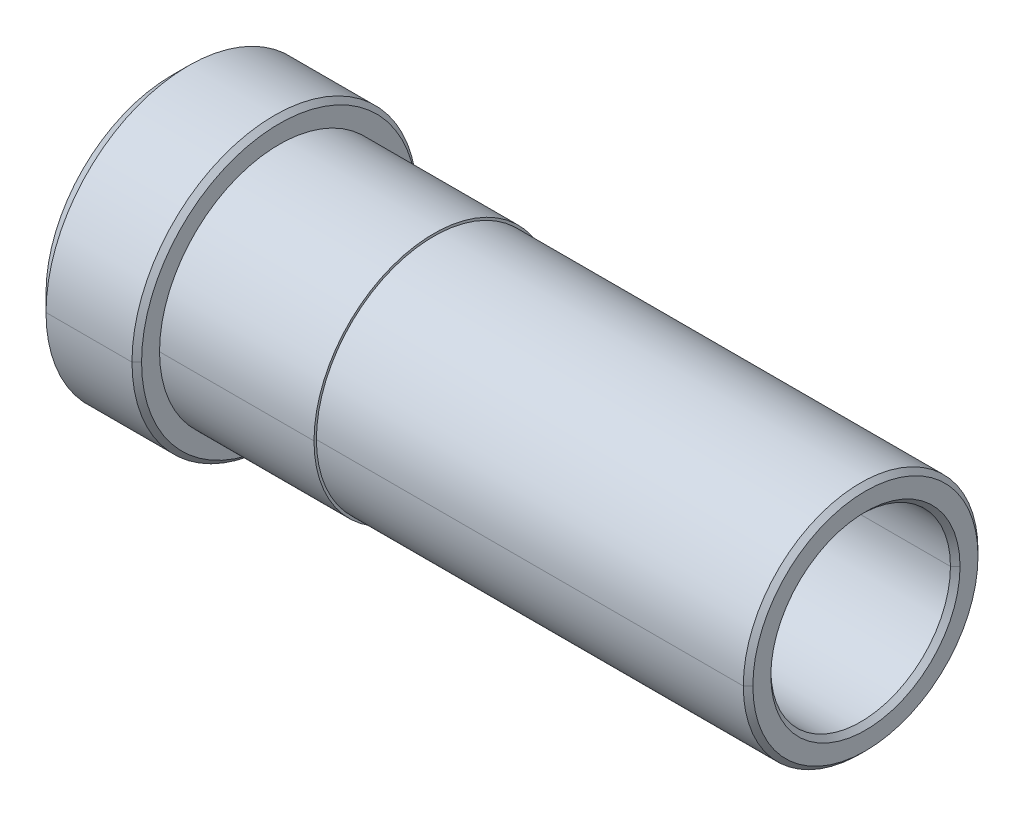
ISO-10303-21;
HEADER;
FILE_DESCRIPTION(('STEP AP214'),'2;1');
FILE_NAME('part.step','',(''),(''),'','','');
FILE_SCHEMA(('AUTOMOTIVE_DESIGN { 1 0 10303 214 1 1 1 1 }'));
ENDSEC;
DATA;
#1=APPLICATION_CONTEXT('core data for automotive mechanical design processes');
#2=APPLICATION_PROTOCOL_DEFINITION('international standard','automotive_design',2000,#1);
#3=PRODUCT_CONTEXT('',#1,'mechanical');
#4=PRODUCT('Part','Part','',(#3));
#5=PRODUCT_RELATED_PRODUCT_CATEGORY('part','',(#4));
#6=PRODUCT_DEFINITION_FORMATION('','',#4);
#7=PRODUCT_DEFINITION_CONTEXT('part definition',#1,'design');
#8=PRODUCT_DEFINITION('design','',#6,#7);
#9=PRODUCT_DEFINITION_SHAPE('','',#8);
#10=(LENGTH_UNIT() NAMED_UNIT(*) SI_UNIT(.MILLI.,.METRE.));
#11=(NAMED_UNIT(*) PLANE_ANGLE_UNIT() SI_UNIT($,.RADIAN.));
#12=(NAMED_UNIT(*) SI_UNIT($,.STERADIAN.) SOLID_ANGLE_UNIT());
#13=UNCERTAINTY_MEASURE_WITH_UNIT(LENGTH_MEASURE(1.E-05),#10,'distance_accuracy_value','');
#14=(GEOMETRIC_REPRESENTATION_CONTEXT(3) GLOBAL_UNCERTAINTY_ASSIGNED_CONTEXT((#13)) GLOBAL_UNIT_ASSIGNED_CONTEXT((#10,
#11,#12)) REPRESENTATION_CONTEXT('',''));
#15=CARTESIAN_POINT('',(0.,0.,0.));
#16=DIRECTION('',(0.,0.,1.));
#17=DIRECTION('',(1.,0.,0.));
#18=AXIS2_PLACEMENT_3D('',#15,#16,#17);
#19=CARTESIAN_POINT('',(-0.1905,0.,0.));
#20=DIRECTION('',(1.,0.,0.));
#21=DIRECTION('',(0.,0.,-1.));
#22=AXIS2_PLACEMENT_3D('',#19,#20,#21);
#23=CONICAL_SURFACE('',#22,4.7625,0.785398163397448);
#24=DIRECTION('',(0.707106781186548,0.,0.707106781186548));
#25=VECTOR('',#24,1.);
#26=CARTESIAN_POINT('',(-0.1905,0.,4.7625));
#27=LINE('',#26,#25);
#28=CARTESIAN_POINT('',(-0.1905,0.,4.7625));
#29=VERTEX_POINT('',#28);
#30=CARTESIAN_POINT('',(0.0635,0.,5.0165));
#31=VERTEX_POINT('',#30);
#32=EDGE_CURVE('E211',#29,#31,#27,.T.);
#33=ORIENTED_EDGE('',*,*,#32,.F.);
#34=CARTESIAN_POINT('',(-0.1905,0.,0.));
#35=DIRECTION('',(1.,0.,0.));
#36=DIRECTION('',(0.,0.,-1.));
#37=AXIS2_PLACEMENT_3D('',#34,#35,#36);
#38=CIRCLE('',#37,4.7625);
#39=CARTESIAN_POINT('',(-0.1905,0.,-4.7625));
#40=VERTEX_POINT('',#39);
#41=EDGE_CURVE('E277',#40,#29,#38,.T.);
#42=ORIENTED_EDGE('',*,*,#41,.F.);
#43=DIRECTION('',(0.707106781186548,0.,-0.707106781186548));
#44=VECTOR('',#43,1.);
#45=CARTESIAN_POINT('',(-0.1905,0.,-4.7625));
#46=LINE('',#45,#44);
#47=CARTESIAN_POINT('',(0.0635,0.,-5.0165));
#48=VERTEX_POINT('',#47);
#49=EDGE_CURVE('E297',#40,#48,#46,.T.);
#50=ORIENTED_EDGE('',*,*,#49,.T.);
#51=CARTESIAN_POINT('',(0.0635,0.,0.));
#52=DIRECTION('',(-1.,0.,0.));
#53=DIRECTION('',(0.,0.,-1.));
#54=AXIS2_PLACEMENT_3D('',#51,#52,#53);
#55=CIRCLE('',#54,5.0165);
#56=EDGE_CURVE('E27',#31,#48,#55,.T.);
#57=ORIENTED_EDGE('',*,*,#56,.F.);
#58=EDGE_LOOP('',(#33,#42,#50,#57));
#59=FACE_BOUND('',#58,.T.);
#60=ADVANCED_FACE('F16',(#59),#23,.F.);
#61=CARTESIAN_POINT('',(-31.01975,0.,0.));
#62=DIRECTION('',(-1.,0.,0.));
#63=DIRECTION('',(0.,0.,1.));
#64=AXIS2_PLACEMENT_3D('',#61,#62,#63);
#65=CONICAL_SURFACE('',#64,7.3025,0.78539816339745);
#66=DIRECTION('',(-0.707106781186546,0.,-0.707106781186549));
#67=VECTOR('',#66,1.);
#68=CARTESIAN_POINT('',(-31.01975,0.,-7.3025));
#69=LINE('',#68,#67);
#70=CARTESIAN_POINT('',(-31.01975,0.,-7.3025));
#71=VERTEX_POINT('',#70);
#72=CARTESIAN_POINT('',(-31.27375,0.,-7.5565));
#73=VERTEX_POINT('',#72);
#74=EDGE_CURVE('E274',#71,#73,#69,.T.);
#75=ORIENTED_EDGE('',*,*,#74,.F.);
#76=CARTESIAN_POINT('',(-31.01975,0.,0.));
#77=DIRECTION('',(1.,0.,0.));
#78=DIRECTION('',(0.,0.,-1.));
#79=AXIS2_PLACEMENT_3D('',#76,#77,#78);
#80=CIRCLE('',#79,7.3025);
#81=CARTESIAN_POINT('',(-31.01975,0.,7.3025));
#82=VERTEX_POINT('',#81);
#83=EDGE_CURVE('E145',#82,#71,#80,.T.);
#84=ORIENTED_EDGE('',*,*,#83,.F.);
#85=DIRECTION('',(-0.707106781186546,0.,0.707106781186549));
#86=VECTOR('',#85,1.);
#87=CARTESIAN_POINT('',(-31.01975,0.,7.3025));
#88=LINE('',#87,#86);
#89=CARTESIAN_POINT('',(-31.27375,0.,7.5565));
#90=VERTEX_POINT('',#89);
#91=EDGE_CURVE('E169',#82,#90,#88,.T.);
#92=ORIENTED_EDGE('',*,*,#91,.T.);
#93=CARTESIAN_POINT('',(-31.27375,0.,0.));
#94=DIRECTION('',(-1.,0.,0.));
#95=DIRECTION('',(0.,0.,-1.));
#96=AXIS2_PLACEMENT_3D('',#93,#94,#95);
#97=CIRCLE('',#96,7.5565);
#98=EDGE_CURVE('E185',#73,#90,#97,.T.);
#99=ORIENTED_EDGE('',*,*,#98,.F.);
#100=EDGE_LOOP('',(#75,#84,#92,#99));
#101=FACE_BOUND('',#100,.T.);
#102=ADVANCED_FACE('F352',(#101),#65,.T.);
#103=CARTESIAN_POINT('',(-36.72205,0.,0.));
#104=DIRECTION('',(-1.,0.,0.));
#105=DIRECTION('',(0.,0.,1.));
#106=AXIS2_PLACEMENT_3D('',#103,#104,#105);
#107=CONICAL_SURFACE('',#106,5.0165,0.785398163397465);
#108=DIRECTION('',(-0.707106781186536,0.,-0.70710678118656));
#109=VECTOR('',#108,1.);
#110=CARTESIAN_POINT('',(-36.72205,0.,-5.0165));
#111=LINE('',#110,#109);
#112=CARTESIAN_POINT('',(-36.46805,0.,-4.7625));
#113=VERTEX_POINT('',#112);
#114=CARTESIAN_POINT('',(-36.72205,0.,-5.0165));
#115=VERTEX_POINT('',#114);
#116=EDGE_CURVE('E186',#113,#115,#111,.T.);
#117=ORIENTED_EDGE('',*,*,#116,.F.);
#118=CARTESIAN_POINT('',(-36.46805,0.,0.));
#119=DIRECTION('',(-1.,0.,0.));
#120=DIRECTION('',(0.,0.,1.));
#121=AXIS2_PLACEMENT_3D('',#118,#119,#120);
#122=CIRCLE('',#121,4.7625);
#123=CARTESIAN_POINT('',(-36.46805,0.,4.7625));
#124=VERTEX_POINT('',#123);
#125=EDGE_CURVE('E280',#124,#113,#122,.T.);
#126=ORIENTED_EDGE('',*,*,#125,.F.);
#127=DIRECTION('',(-0.707106781186536,0.,0.70710678118656));
#128=VECTOR('',#127,1.);
#129=CARTESIAN_POINT('',(-36.72205,0.,5.0165));
#130=LINE('',#129,#128);
#131=CARTESIAN_POINT('',(-36.72205,0.,5.0165));
#132=VERTEX_POINT('',#131);
#133=EDGE_CURVE('E217',#124,#132,#130,.T.);
#134=ORIENTED_EDGE('',*,*,#133,.T.);
#135=CARTESIAN_POINT('',(-36.72205,0.,0.));
#136=DIRECTION('',(1.,0.,0.));
#137=DIRECTION('',(0.,0.,1.));
#138=AXIS2_PLACEMENT_3D('',#135,#136,#137);
#139=CIRCLE('',#138,5.0165);
#140=EDGE_CURVE('E184',#115,#132,#139,.T.);
#141=ORIENTED_EDGE('',*,*,#140,.F.);
#142=EDGE_LOOP('',(#117,#126,#134,#141));
#143=FACE_BOUND('',#142,.T.);
#144=ADVANCED_FACE('F358',(#143),#107,.F.);
#145=CARTESIAN_POINT('',(0.0635,0.,0.));
#146=DIRECTION('',(-1.,0.,0.));
#147=DIRECTION('',(0.,0.,1.));
#148=AXIS2_PLACEMENT_3D('',#145,#146,#147);
#149=CONICAL_SURFACE('',#148,5.969,0.78539816339744);
#150=DIRECTION('',(-0.707106781186554,0.,-0.707106781186542));
#151=VECTOR('',#150,1.);
#152=CARTESIAN_POINT('',(0.0635,0.,-5.969));
#153=LINE('',#152,#151);
#154=CARTESIAN_POINT('',(0.0635,0.,-5.969));
#155=VERTEX_POINT('',#154);
#156=CARTESIAN_POINT('',(-0.1905,0.,-6.223));
#157=VERTEX_POINT('',#156);
#158=EDGE_CURVE('E221',#155,#157,#153,.T.);
#159=ORIENTED_EDGE('',*,*,#158,.F.);
#160=CARTESIAN_POINT('',(0.0635,0.,0.));
#161=DIRECTION('',(1.,0.,0.));
#162=DIRECTION('',(0.,0.,-1.));
#163=AXIS2_PLACEMENT_3D('',#160,#161,#162);
#164=CIRCLE('',#163,5.969);
#165=CARTESIAN_POINT('',(0.0635,0.,5.969));
#166=VERTEX_POINT('',#165);
#167=EDGE_CURVE('E279',#166,#155,#164,.T.);
#168=ORIENTED_EDGE('',*,*,#167,.F.);
#169=DIRECTION('',(-0.707106781186554,0.,0.707106781186542));
#170=VECTOR('',#169,1.);
#171=CARTESIAN_POINT('',(0.0635,0.,5.969));
#172=LINE('',#171,#170);
#173=CARTESIAN_POINT('',(-0.1905,0.,6.223));
#174=VERTEX_POINT('',#173);
#175=EDGE_CURVE('E234',#166,#174,#172,.T.);
#176=ORIENTED_EDGE('',*,*,#175,.T.);
#177=CARTESIAN_POINT('',(-0.1905,0.,0.));
#178=DIRECTION('',(-1.,0.,0.));
#179=DIRECTION('',(0.,0.,-1.));
#180=AXIS2_PLACEMENT_3D('',#177,#178,#179);
#181=CIRCLE('',#180,6.223);
#182=EDGE_CURVE('E11',#157,#174,#181,.T.);
#183=ORIENTED_EDGE('',*,*,#182,.F.);
#184=EDGE_LOOP('',(#159,#168,#176,#183));
#185=FACE_BOUND('',#184,.T.);
#186=ADVANCED_FACE('F363',(#185),#149,.T.);
#187=CARTESIAN_POINT('',(-35.83305,0.,0.));
#188=DIRECTION('',(1.,0.,0.));
#189=DIRECTION('',(0.,0.,-1.));
#190=AXIS2_PLACEMENT_3D('',#187,#188,#189);
#191=CONICAL_SURFACE('',#190,7.5565,0.785398163397449);
#192=DIRECTION('',(0.707106781186547,0.,0.707106781186548));
#193=VECTOR('',#192,1.);
#194=CARTESIAN_POINT('',(-35.83305,0.,7.5565));
#195=LINE('',#194,#193);
#196=CARTESIAN_POINT('',(-36.72205,0.,6.6675));
#197=VERTEX_POINT('',#196);
#198=CARTESIAN_POINT('',(-35.83305,0.,7.5565));
#199=VERTEX_POINT('',#198);
#200=EDGE_CURVE('E175',#197,#199,#195,.T.);
#201=ORIENTED_EDGE('',*,*,#200,.F.);
#202=CARTESIAN_POINT('',(-36.72205,0.,0.));
#203=DIRECTION('',(-1.,0.,0.));
#204=DIRECTION('',(0.,0.,1.));
#205=AXIS2_PLACEMENT_3D('',#202,#203,#204);
#206=CIRCLE('',#205,6.6675);
#207=CARTESIAN_POINT('',(-36.72205,0.,-6.6675));
#208=VERTEX_POINT('',#207);
#209=EDGE_CURVE('E181',#208,#197,#206,.T.);
#210=ORIENTED_EDGE('',*,*,#209,.F.);
#211=DIRECTION('',(0.707106781186547,0.,-0.707106781186548));
#212=VECTOR('',#211,1.);
#213=CARTESIAN_POINT('',(-35.83305,0.,-7.5565));
#214=LINE('',#213,#212);
#215=CARTESIAN_POINT('',(-35.83305,0.,-7.5565));
#216=VERTEX_POINT('',#215);
#217=EDGE_CURVE('E201',#208,#216,#214,.T.);
#218=ORIENTED_EDGE('',*,*,#217,.T.);
#219=CARTESIAN_POINT('',(-35.83305,0.,0.));
#220=DIRECTION('',(1.,0.,0.));
#221=DIRECTION('',(0.,0.,1.));
#222=AXIS2_PLACEMENT_3D('',#219,#220,#221);
#223=CIRCLE('',#222,7.5565);
#224=EDGE_CURVE('E208',#199,#216,#223,.T.);
#225=ORIENTED_EDGE('',*,*,#224,.F.);
#226=EDGE_LOOP('',(#201,#210,#218,#225));
#227=FACE_BOUND('',#226,.T.);
#228=ADVANCED_FACE('F251',(#227),#191,.T.);
#229=CARTESIAN_POINT('',(0.,0.,0.));
#230=DIRECTION('',(1.,0.,0.));
#231=DIRECTION('',(0.,0.,-1.));
#232=AXIS2_PLACEMENT_3D('',#229,#230,#231);
#233=CYLINDRICAL_SURFACE('',#232,6.223);
#234=DIRECTION('',(1.,0.,0.));
#235=VECTOR('',#234,1.);
#236=CARTESIAN_POINT('',(0.,0.,6.223));
#237=LINE('',#236,#235);
#238=CARTESIAN_POINT('',(-22.82825,0.,6.223));
#239=VERTEX_POINT('',#238);
#240=EDGE_CURVE('E200',#239,#174,#237,.T.);
#241=ORIENTED_EDGE('',*,*,#240,.F.);
#242=CARTESIAN_POINT('',(-22.82825,0.,0.));
#243=DIRECTION('',(1.,0.,0.));
#244=DIRECTION('',(0.,0.,-1.));
#245=AXIS2_PLACEMENT_3D('',#242,#243,#244);
#246=CIRCLE('',#245,6.223);
#247=CARTESIAN_POINT('',(-22.82825,0.,-6.223));
#248=VERTEX_POINT('',#247);
#249=EDGE_CURVE('E146',#239,#248,#246,.T.);
#250=ORIENTED_EDGE('',*,*,#249,.T.);
#251=DIRECTION('',(1.,0.,0.));
#252=VECTOR('',#251,1.);
#253=CARTESIAN_POINT('',(0.,0.,-6.223));
#254=LINE('',#253,#252);
#255=EDGE_CURVE('E306',#248,#157,#254,.T.);
#256=ORIENTED_EDGE('',*,*,#255,.T.);
#257=ORIENTED_EDGE('',*,*,#182,.T.);
#258=EDGE_LOOP('',(#241,#250,#256,#257));
#259=FACE_BOUND('',#258,.T.);
#260=ADVANCED_FACE('F414',(#259),#233,.T.);
#261=CARTESIAN_POINT('',(0.0635,6.223,0.));
#262=DIRECTION('',(1.,0.,0.));
#263=DIRECTION('',(0.,1.,0.));
#264=AXIS2_PLACEMENT_3D('',#261,#262,#263);
#265=PLANE('',#264);
#266=CARTESIAN_POINT('',(0.0635,0.,0.));
#267=DIRECTION('',(-1.,0.,0.));
#268=DIRECTION('',(0.,0.,-1.));
#269=AXIS2_PLACEMENT_3D('',#266,#267,#268);
#270=CIRCLE('',#269,5.0165);
#271=EDGE_CURVE('E215',#48,#31,#270,.T.);
#272=ORIENTED_EDGE('',*,*,#271,.T.);
#273=ORIENTED_EDGE('',*,*,#56,.T.);
#274=EDGE_LOOP('',(#272,#273));
#275=FACE_BOUND('',#274,.T.);
#276=ORIENTED_EDGE('',*,*,#167,.T.);
#277=CARTESIAN_POINT('',(0.0635,0.,0.));
#278=DIRECTION('',(1.,0.,0.));
#279=DIRECTION('',(0.,0.,-1.));
#280=AXIS2_PLACEMENT_3D('',#277,#278,#279);
#281=CIRCLE('',#280,5.969);
#282=EDGE_CURVE('E220',#155,#166,#281,.T.);
#283=ORIENTED_EDGE('',*,*,#282,.T.);
#284=EDGE_LOOP('',(#276,#283));
#285=FACE_BOUND('',#284,.T.);
#286=ADVANCED_FACE('F399',(#275,#285),#265,.T.);
#287=CARTESIAN_POINT('',(0.,0.,0.));
#288=DIRECTION('',(1.,0.,0.));
#289=DIRECTION('',(0.,0.,-1.));
#290=AXIS2_PLACEMENT_3D('',#287,#288,#289);
#291=CYLINDRICAL_SURFACE('',#290,4.7625);
#292=DIRECTION('',(1.,0.,0.));
#293=VECTOR('',#292,1.);
#294=CARTESIAN_POINT('',(0.,0.,4.7625));
#295=LINE('',#294,#293);
#296=EDGE_CURVE('E195',#124,#29,#295,.T.);
#297=ORIENTED_EDGE('',*,*,#296,.F.);
#298=ORIENTED_EDGE('',*,*,#125,.T.);
#299=DIRECTION('',(1.,0.,0.));
#300=VECTOR('',#299,1.);
#301=CARTESIAN_POINT('',(0.,0.,-4.7625));
#302=LINE('',#301,#300);
#303=EDGE_CURVE('E191',#113,#40,#302,.T.);
#304=ORIENTED_EDGE('',*,*,#303,.T.);
#305=ORIENTED_EDGE('',*,*,#41,.T.);
#306=EDGE_LOOP('',(#297,#298,#304,#305));
#307=FACE_BOUND('',#306,.T.);
#308=ADVANCED_FACE('F392',(#307),#291,.F.);
#309=CARTESIAN_POINT('',(-36.72205,4.7625,0.));
#310=DIRECTION('',(-1.,0.,0.));
#311=DIRECTION('',(0.,0.,1.));
#312=AXIS2_PLACEMENT_3D('',#309,#310,#311);
#313=PLANE('',#312);
#314=CARTESIAN_POINT('',(-36.72205,0.,0.));
#315=DIRECTION('',(1.,0.,0.));
#316=DIRECTION('',(0.,0.,1.));
#317=AXIS2_PLACEMENT_3D('',#314,#315,#316);
#318=CIRCLE('',#317,5.0165);
#319=EDGE_CURVE('E190',#132,#115,#318,.T.);
#320=ORIENTED_EDGE('',*,*,#319,.T.);
#321=ORIENTED_EDGE('',*,*,#140,.T.);
#322=EDGE_LOOP('',(#320,#321));
#323=FACE_BOUND('',#322,.T.);
#324=ORIENTED_EDGE('',*,*,#209,.T.);
#325=CARTESIAN_POINT('',(-36.72205,0.,0.));
#326=DIRECTION('',(-1.,0.,0.));
#327=DIRECTION('',(0.,0.,1.));
#328=AXIS2_PLACEMENT_3D('',#325,#326,#327);
#329=CIRCLE('',#328,6.6675);
#330=EDGE_CURVE('E180',#197,#208,#329,.T.);
#331=ORIENTED_EDGE('',*,*,#330,.T.);
#332=EDGE_LOOP('',(#324,#331));
#333=FACE_BOUND('',#332,.T.);
#334=ADVANCED_FACE('F389',(#323,#333),#313,.T.);
#335=CARTESIAN_POINT('',(0.,0.,0.));
#336=DIRECTION('',(1.,0.,0.));
#337=DIRECTION('',(0.,0.,-1.));
#338=AXIS2_PLACEMENT_3D('',#335,#336,#337);
#339=CYLINDRICAL_SURFACE('',#338,7.5565);
#340=DIRECTION('',(1.,0.,0.));
#341=VECTOR('',#340,1.);
#342=CARTESIAN_POINT('',(0.,0.,7.5565));
#343=LINE('',#342,#341);
#344=EDGE_CURVE('E165',#199,#90,#343,.T.);
#345=ORIENTED_EDGE('',*,*,#344,.F.);
#346=ORIENTED_EDGE('',*,*,#224,.T.);
#347=DIRECTION('',(1.,0.,0.));
#348=VECTOR('',#347,1.);
#349=CARTESIAN_POINT('',(0.,0.,-7.5565));
#350=LINE('',#349,#348);
#351=EDGE_CURVE('E156',#216,#73,#350,.T.);
#352=ORIENTED_EDGE('',*,*,#351,.T.);
#353=ORIENTED_EDGE('',*,*,#98,.T.);
#354=EDGE_LOOP('',(#345,#346,#352,#353));
#355=FACE_BOUND('',#354,.T.);
#356=ADVANCED_FACE('F264',(#355),#339,.T.);
#357=CARTESIAN_POINT('',(-31.01975,7.5565,0.));
#358=DIRECTION('',(1.,0.,0.));
#359=DIRECTION('',(0.,1.,0.));
#360=AXIS2_PLACEMENT_3D('',#357,#358,#359);
#361=PLANE('',#360);
#362=CARTESIAN_POINT('',(-31.01975,0.,0.));
#363=DIRECTION('',(1.,0.,0.));
#364=DIRECTION('',(0.,0.,-1.));
#365=AXIS2_PLACEMENT_3D('',#362,#363,#364);
#366=CIRCLE('',#365,6.35);
#367=CARTESIAN_POINT('',(-31.01975,0.,-6.35));
#368=VERTEX_POINT('',#367);
#369=CARTESIAN_POINT('',(-31.01975,0.,6.35));
#370=VERTEX_POINT('',#369);
#371=EDGE_CURVE('E150',#368,#370,#366,.T.);
#372=ORIENTED_EDGE('',*,*,#371,.F.);
#373=CARTESIAN_POINT('',(-31.01975,0.,0.));
#374=DIRECTION('',(1.,0.,0.));
#375=DIRECTION('',(0.,0.,-1.));
#376=AXIS2_PLACEMENT_3D('',#373,#374,#375);
#377=CIRCLE('',#376,6.35);
#378=EDGE_CURVE('E135',#370,#368,#377,.T.);
#379=ORIENTED_EDGE('',*,*,#378,.F.);
#380=EDGE_LOOP('',(#372,#379));
#381=FACE_BOUND('',#380,.T.);
#382=ORIENTED_EDGE('',*,*,#83,.T.);
#383=CARTESIAN_POINT('',(-31.01975,0.,0.));
#384=DIRECTION('',(1.,0.,0.));
#385=DIRECTION('',(0.,0.,-1.));
#386=AXIS2_PLACEMENT_3D('',#383,#384,#385);
#387=CIRCLE('',#386,7.3025);
#388=EDGE_CURVE('E276',#71,#82,#387,.T.);
#389=ORIENTED_EDGE('',*,*,#388,.T.);
#390=EDGE_LOOP('',(#382,#389));
#391=FACE_BOUND('',#390,.T.);
#392=ADVANCED_FACE('F153',(#381,#391),#361,.T.);
#393=CARTESIAN_POINT('',(0.,0.,0.));
#394=DIRECTION('',(1.,0.,0.));
#395=DIRECTION('',(0.,0.,-1.));
#396=AXIS2_PLACEMENT_3D('',#393,#394,#395);
#397=CYLINDRICAL_SURFACE('',#396,6.35);
#398=DIRECTION('',(1.,0.,0.));
#399=VECTOR('',#398,1.);
#400=CARTESIAN_POINT('',(0.,0.,6.35));
#401=LINE('',#400,#399);
#402=CARTESIAN_POINT('',(-22.82825,0.,6.35));
#403=VERTEX_POINT('',#402);
#404=EDGE_CURVE('E140',#370,#403,#401,.T.);
#405=ORIENTED_EDGE('',*,*,#404,.F.);
#406=ORIENTED_EDGE('',*,*,#378,.T.);
#407=DIRECTION('',(1.,0.,0.));
#408=VECTOR('',#407,1.);
#409=CARTESIAN_POINT('',(0.,0.,-6.35));
#410=LINE('',#409,#408);
#411=CARTESIAN_POINT('',(-22.82825,0.,-6.35));
#412=VERTEX_POINT('',#411);
#413=EDGE_CURVE('E20',#368,#412,#410,.T.);
#414=ORIENTED_EDGE('',*,*,#413,.T.);
#415=CARTESIAN_POINT('',(-22.82825,0.,0.));
#416=DIRECTION('',(1.,0.,0.));
#417=DIRECTION('',(0.,0.,-1.));
#418=AXIS2_PLACEMENT_3D('',#415,#416,#417);
#419=CIRCLE('',#418,6.35);
#420=EDGE_CURVE('E41',#403,#412,#419,.T.);
#421=ORIENTED_EDGE('',*,*,#420,.F.);
#422=EDGE_LOOP('',(#405,#406,#414,#421));
#423=FACE_BOUND('',#422,.T.);
#424=ADVANCED_FACE('F137',(#423),#397,.T.);
#425=CARTESIAN_POINT('',(-22.82825,6.35,0.));
#426=DIRECTION('',(1.,0.,0.));
#427=DIRECTION('',(0.,1.,0.));
#428=AXIS2_PLACEMENT_3D('',#425,#426,#427);
#429=PLANE('',#428);
#430=CARTESIAN_POINT('',(-22.82825,0.,0.));
#431=DIRECTION('',(1.,0.,0.));
#432=DIRECTION('',(0.,0.,-1.));
#433=AXIS2_PLACEMENT_3D('',#430,#431,#432);
#434=CIRCLE('',#433,6.223);
#435=EDGE_CURVE('E196',#248,#239,#434,.T.);
#436=ORIENTED_EDGE('',*,*,#435,.F.);
#437=ORIENTED_EDGE('',*,*,#249,.F.);
#438=EDGE_LOOP('',(#436,#437));
#439=FACE_BOUND('',#438,.T.);
#440=CARTESIAN_POINT('',(-22.82825,0.,0.));
#441=DIRECTION('',(1.,0.,0.));
#442=DIRECTION('',(0.,0.,-1.));
#443=AXIS2_PLACEMENT_3D('',#440,#441,#442);
#444=CIRCLE('',#443,6.35);
#445=EDGE_CURVE('E151',#412,#403,#444,.T.);
#446=ORIENTED_EDGE('',*,*,#445,.T.);
#447=ORIENTED_EDGE('',*,*,#420,.T.);
#448=EDGE_LOOP('',(#446,#447));
#449=FACE_BOUND('',#448,.T.);
#450=ADVANCED_FACE('F337',(#439,#449),#429,.T.);
#451=CARTESIAN_POINT('',(0.,0.,0.));
#452=DIRECTION('',(1.,0.,0.));
#453=DIRECTION('',(0.,0.,-1.));
#454=AXIS2_PLACEMENT_3D('',#451,#452,#453);
#455=CYLINDRICAL_SURFACE('',#454,6.35);
#456=ORIENTED_EDGE('',*,*,#371,.T.);
#457=ORIENTED_EDGE('',*,*,#404,.T.);
#458=ORIENTED_EDGE('',*,*,#445,.F.);
#459=ORIENTED_EDGE('',*,*,#413,.F.);
#460=EDGE_LOOP('',(#456,#457,#458,#459));
#461=FACE_BOUND('',#460,.T.);
#462=ADVANCED_FACE('F149',(#461),#455,.T.);
#463=CARTESIAN_POINT('',(0.,0.,0.));
#464=DIRECTION('',(1.,0.,0.));
#465=DIRECTION('',(0.,0.,-1.));
#466=AXIS2_PLACEMENT_3D('',#463,#464,#465);
#467=CYLINDRICAL_SURFACE('',#466,7.5565);
#468=CARTESIAN_POINT('',(-35.83305,0.,0.));
#469=DIRECTION('',(1.,0.,0.));
#470=DIRECTION('',(0.,0.,1.));
#471=AXIS2_PLACEMENT_3D('',#468,#469,#470);
#472=CIRCLE('',#471,7.5565);
#473=EDGE_CURVE('E179',#216,#199,#472,.T.);
#474=ORIENTED_EDGE('',*,*,#473,.T.);
#475=ORIENTED_EDGE('',*,*,#344,.T.);
#476=CARTESIAN_POINT('',(-31.27375,0.,0.));
#477=DIRECTION('',(-1.,0.,0.));
#478=DIRECTION('',(0.,0.,-1.));
#479=AXIS2_PLACEMENT_3D('',#476,#477,#478);
#480=CIRCLE('',#479,7.5565);
#481=EDGE_CURVE('E174',#90,#73,#480,.T.);
#482=ORIENTED_EDGE('',*,*,#481,.T.);
#483=ORIENTED_EDGE('',*,*,#351,.F.);
#484=EDGE_LOOP('',(#474,#475,#482,#483));
#485=FACE_BOUND('',#484,.T.);
#486=ADVANCED_FACE('F259',(#485),#467,.T.);
#487=CARTESIAN_POINT('',(0.,0.,0.));
#488=DIRECTION('',(1.,0.,0.));
#489=DIRECTION('',(0.,0.,-1.));
#490=AXIS2_PLACEMENT_3D('',#487,#488,#489);
#491=CYLINDRICAL_SURFACE('',#490,4.7625);
#492=CARTESIAN_POINT('',(-36.46805,0.,0.));
#493=DIRECTION('',(-1.,0.,0.));
#494=DIRECTION('',(0.,0.,1.));
#495=AXIS2_PLACEMENT_3D('',#492,#493,#494);
#496=CIRCLE('',#495,4.7625);
#497=EDGE_CURVE('E173',#113,#124,#496,.T.);
#498=ORIENTED_EDGE('',*,*,#497,.T.);
#499=ORIENTED_EDGE('',*,*,#296,.T.);
#500=CARTESIAN_POINT('',(-0.1905,0.,0.));
#501=DIRECTION('',(1.,0.,0.));
#502=DIRECTION('',(0.,0.,-1.));
#503=AXIS2_PLACEMENT_3D('',#500,#501,#502);
#504=CIRCLE('',#503,4.7625);
#505=EDGE_CURVE('E216',#29,#40,#504,.T.);
#506=ORIENTED_EDGE('',*,*,#505,.T.);
#507=ORIENTED_EDGE('',*,*,#303,.F.);
#508=EDGE_LOOP('',(#498,#499,#506,#507));
#509=FACE_BOUND('',#508,.T.);
#510=ADVANCED_FACE('F367',(#509),#491,.F.);
#511=CARTESIAN_POINT('',(0.,0.,0.));
#512=DIRECTION('',(1.,0.,0.));
#513=DIRECTION('',(0.,0.,-1.));
#514=AXIS2_PLACEMENT_3D('',#511,#512,#513);
#515=CYLINDRICAL_SURFACE('',#514,6.223);
#516=ORIENTED_EDGE('',*,*,#435,.T.);
#517=ORIENTED_EDGE('',*,*,#240,.T.);
#518=CARTESIAN_POINT('',(-0.1905,0.,0.));
#519=DIRECTION('',(-1.,0.,0.));
#520=DIRECTION('',(0.,0.,-1.));
#521=AXIS2_PLACEMENT_3D('',#518,#519,#520);
#522=CIRCLE('',#521,6.223);
#523=EDGE_CURVE('E224',#174,#157,#522,.T.);
#524=ORIENTED_EDGE('',*,*,#523,.T.);
#525=ORIENTED_EDGE('',*,*,#255,.F.);
#526=EDGE_LOOP('',(#516,#517,#524,#525));
#527=FACE_BOUND('',#526,.T.);
#528=ADVANCED_FACE('F365',(#527),#515,.T.);
#529=CARTESIAN_POINT('',(-35.83305,0.,0.));
#530=DIRECTION('',(1.,0.,0.));
#531=DIRECTION('',(0.,0.,-1.));
#532=AXIS2_PLACEMENT_3D('',#529,#530,#531);
#533=CONICAL_SURFACE('',#532,7.5565,0.785398163397449);
#534=ORIENTED_EDGE('',*,*,#330,.F.);
#535=ORIENTED_EDGE('',*,*,#200,.T.);
#536=ORIENTED_EDGE('',*,*,#473,.F.);
#537=ORIENTED_EDGE('',*,*,#217,.F.);
#538=EDGE_LOOP('',(#534,#535,#536,#537));
#539=FACE_BOUND('',#538,.T.);
#540=ADVANCED_FACE('F256',(#539),#533,.T.);
#541=CARTESIAN_POINT('',(0.0635,0.,0.));
#542=DIRECTION('',(-1.,0.,0.));
#543=DIRECTION('',(0.,0.,1.));
#544=AXIS2_PLACEMENT_3D('',#541,#542,#543);
#545=CONICAL_SURFACE('',#544,5.969,0.78539816339744);
#546=ORIENTED_EDGE('',*,*,#282,.F.);
#547=ORIENTED_EDGE('',*,*,#158,.T.);
#548=ORIENTED_EDGE('',*,*,#523,.F.);
#549=ORIENTED_EDGE('',*,*,#175,.F.);
#550=EDGE_LOOP('',(#546,#547,#548,#549));
#551=FACE_BOUND('',#550,.T.);
#552=ADVANCED_FACE('F18',(#551),#545,.T.);
#553=CARTESIAN_POINT('',(-36.72205,0.,0.));
#554=DIRECTION('',(-1.,0.,0.));
#555=DIRECTION('',(0.,0.,1.));
#556=AXIS2_PLACEMENT_3D('',#553,#554,#555);
#557=CONICAL_SURFACE('',#556,5.0165,0.785398163397465);
#558=ORIENTED_EDGE('',*,*,#497,.F.);
#559=ORIENTED_EDGE('',*,*,#116,.T.);
#560=ORIENTED_EDGE('',*,*,#319,.F.);
#561=ORIENTED_EDGE('',*,*,#133,.F.);
#562=EDGE_LOOP('',(#558,#559,#560,#561));
#563=FACE_BOUND('',#562,.T.);
#564=ADVANCED_FACE('F369',(#563),#557,.F.);
#565=CARTESIAN_POINT('',(-31.01975,0.,0.));
#566=DIRECTION('',(-1.,0.,0.));
#567=DIRECTION('',(0.,0.,1.));
#568=AXIS2_PLACEMENT_3D('',#565,#566,#567);
#569=CONICAL_SURFACE('',#568,7.3025,0.78539816339745);
#570=ORIENTED_EDGE('',*,*,#388,.F.);
#571=ORIENTED_EDGE('',*,*,#74,.T.);
#572=ORIENTED_EDGE('',*,*,#481,.F.);
#573=ORIENTED_EDGE('',*,*,#91,.F.);
#574=EDGE_LOOP('',(#570,#571,#572,#573));
#575=FACE_BOUND('',#574,.T.);
#576=ADVANCED_FACE('F371',(#575),#569,.T.);
#577=CARTESIAN_POINT('',(-0.1905,0.,0.));
#578=DIRECTION('',(1.,0.,0.));
#579=DIRECTION('',(0.,0.,-1.));
#580=AXIS2_PLACEMENT_3D('',#577,#578,#579);
#581=CONICAL_SURFACE('',#580,4.7625,0.785398163397448);
#582=ORIENTED_EDGE('',*,*,#505,.F.);
#583=ORIENTED_EDGE('',*,*,#32,.T.);
#584=ORIENTED_EDGE('',*,*,#271,.F.);
#585=ORIENTED_EDGE('',*,*,#49,.F.);
#586=EDGE_LOOP('',(#582,#583,#584,#585));
#587=FACE_BOUND('',#586,.T.);
#588=ADVANCED_FACE('F377',(#587),#581,.F.);
#589=CLOSED_SHELL('',(#60,#102,#144,#186,#228,#260,#286,#308,#334,#356,#392,#424,#450,#462,#486,
#510,#528,#540,#552,#564,#576,#588));
#590=MANIFOLD_SOLID_BREP('B1',#589);
#591=ADVANCED_BREP_SHAPE_REPRESENTATION('',(#18,#590),#14);
#592=SHAPE_DEFINITION_REPRESENTATION(#9,#591);
ENDSEC;
END-ISO-10303-21;
